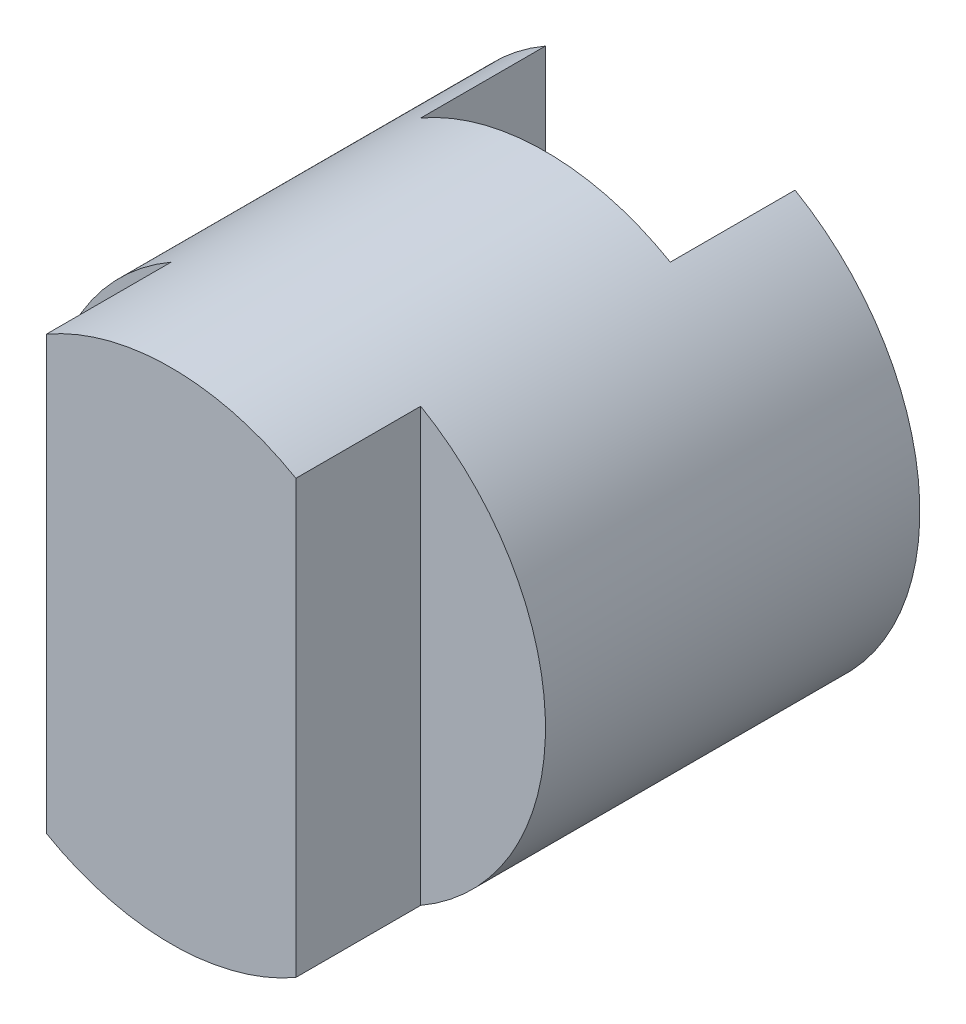
ISO-10303-21;
HEADER;
FILE_DESCRIPTION(('STEP AP214'),'2;1');
FILE_NAME('part.step','',(''),(''),'','','');
FILE_SCHEMA(('AUTOMOTIVE_DESIGN { 1 0 10303 214 1 1 1 1 }'));
ENDSEC;
DATA;
#1=APPLICATION_CONTEXT('core data for automotive mechanical design processes');
#2=APPLICATION_PROTOCOL_DEFINITION('international standard','automotive_design',2000,#1);
#3=PRODUCT_CONTEXT('',#1,'mechanical');
#4=PRODUCT('Part','Part','',(#3));
#5=PRODUCT_RELATED_PRODUCT_CATEGORY('part','',(#4));
#6=PRODUCT_DEFINITION_FORMATION('','',#4);
#7=PRODUCT_DEFINITION_CONTEXT('part definition',#1,'design');
#8=PRODUCT_DEFINITION('design','',#6,#7);
#9=PRODUCT_DEFINITION_SHAPE('','',#8);
#10=(LENGTH_UNIT() NAMED_UNIT(*) SI_UNIT(.MILLI.,.METRE.));
#11=(NAMED_UNIT(*) PLANE_ANGLE_UNIT() SI_UNIT($,.RADIAN.));
#12=(NAMED_UNIT(*) SI_UNIT($,.STERADIAN.) SOLID_ANGLE_UNIT());
#13=UNCERTAINTY_MEASURE_WITH_UNIT(LENGTH_MEASURE(1.E-05),#10,'distance_accuracy_value','');
#14=(GEOMETRIC_REPRESENTATION_CONTEXT(3) GLOBAL_UNCERTAINTY_ASSIGNED_CONTEXT((#13)) GLOBAL_UNIT_ASSIGNED_CONTEXT((#10,
#11,#12)) REPRESENTATION_CONTEXT('',''));
#15=CARTESIAN_POINT('',(0.,0.,0.));
#16=DIRECTION('',(0.,0.,1.));
#17=DIRECTION('',(1.,0.,0.));
#18=AXIS2_PLACEMENT_3D('',#15,#16,#17);
#19=CARTESIAN_POINT('',(0.,0.,0.));
#20=DIRECTION('',(0.,0.,1.));
#21=DIRECTION('',(1.,0.,0.));
#22=AXIS2_PLACEMENT_3D('',#19,#20,#21);
#23=PLANE('',#22);
#24=CARTESIAN_POINT('',(0.,0.,0.));
#25=DIRECTION('',(0.,0.,1.));
#26=DIRECTION('',(1.,0.,0.));
#27=AXIS2_PLACEMENT_3D('',#24,#25,#26);
#28=CIRCLE('',#27,2.);
#29=CARTESIAN_POINT('',(1.,-1.73205080756888,0.));
#30=VERTEX_POINT('',#29);
#31=CARTESIAN_POINT('',(1.,1.73205080756888,0.));
#32=VERTEX_POINT('',#31);
#33=EDGE_CURVE('E122',#30,#32,#28,.T.);
#34=ORIENTED_EDGE('',*,*,#33,.F.);
#35=DIRECTION('',(0.,1.,0.));
#36=VECTOR('',#35,1.);
#37=CARTESIAN_POINT('',(1.,0.,0.));
#38=LINE('',#37,#36);
#39=EDGE_CURVE('E109',#30,#32,#38,.T.);
#40=ORIENTED_EDGE('',*,*,#39,.T.);
#41=EDGE_LOOP('',(#34,#40));
#42=FACE_BOUND('',#41,.T.);
#43=ADVANCED_FACE('F32',(#42),#23,.F.);
#44=CARTESIAN_POINT('',(0.,0.,4.));
#45=DIRECTION('',(0.,0.,-1.));
#46=DIRECTION('',(-1.,0.,0.));
#47=AXIS2_PLACEMENT_3D('',#44,#45,#46);
#48=CYLINDRICAL_SURFACE('',#47,2.);
#49=CARTESIAN_POINT('',(0.,0.,4.));
#50=DIRECTION('',(0.,0.,1.));
#51=DIRECTION('',(1.,0.,0.));
#52=AXIS2_PLACEMENT_3D('',#49,#50,#51);
#53=CIRCLE('',#52,2.);
#54=CARTESIAN_POINT('',(-1.,-1.73205080756888,4.));
#55=VERTEX_POINT('',#54);
#56=CARTESIAN_POINT('',(1.,-1.73205080756888,4.));
#57=VERTEX_POINT('',#56);
#58=EDGE_CURVE('E121',#55,#57,#53,.T.);
#59=ORIENTED_EDGE('',*,*,#58,.F.);
#60=DIRECTION('',(0.,0.,-1.));
#61=VECTOR('',#60,1.);
#62=CARTESIAN_POINT('',(-1.,-1.73205080756888,4.));
#63=LINE('',#62,#61);
#64=CARTESIAN_POINT('',(-1.,-1.73205080756888,3.));
#65=VERTEX_POINT('',#64);
#66=EDGE_CURVE('E47',#55,#65,#63,.T.);
#67=ORIENTED_EDGE('',*,*,#66,.T.);
#68=CARTESIAN_POINT('',(0.,0.,3.));
#69=DIRECTION('',(0.,0.,-1.));
#70=DIRECTION('',(-1.,0.,0.));
#71=AXIS2_PLACEMENT_3D('',#68,#69,#70);
#72=CIRCLE('',#71,2.);
#73=CARTESIAN_POINT('',(-1.,1.73205080756888,3.));
#74=VERTEX_POINT('',#73);
#75=EDGE_CURVE('E11',#65,#74,#72,.T.);
#76=ORIENTED_EDGE('',*,*,#75,.T.);
#77=DIRECTION('',(0.,0.,-1.));
#78=VECTOR('',#77,1.);
#79=CARTESIAN_POINT('',(-1.,1.73205080756888,4.));
#80=LINE('',#79,#78);
#81=CARTESIAN_POINT('',(-1.,1.73205080756888,4.));
#82=VERTEX_POINT('',#81);
#83=EDGE_CURVE('E164',#74,#82,#80,.F.);
#84=ORIENTED_EDGE('',*,*,#83,.T.);
#85=CARTESIAN_POINT('',(1.,1.73205080756888,4.));
#86=VERTEX_POINT('',#85);
#87=EDGE_CURVE('E110',#86,#82,#53,.T.);
#88=ORIENTED_EDGE('',*,*,#87,.F.);
#89=DIRECTION('',(0.,0.,-1.));
#90=VECTOR('',#89,1.);
#91=CARTESIAN_POINT('',(1.,1.73205080756888,4.));
#92=LINE('',#91,#90);
#93=CARTESIAN_POINT('',(1.,1.73205080756888,3.));
#94=VERTEX_POINT('',#93);
#95=EDGE_CURVE('E55',#86,#94,#92,.T.);
#96=ORIENTED_EDGE('',*,*,#95,.T.);
#97=CARTESIAN_POINT('',(0.,0.,3.));
#98=DIRECTION('',(0.,0.,-1.));
#99=DIRECTION('',(-1.,0.,0.));
#100=AXIS2_PLACEMENT_3D('',#97,#98,#99);
#101=CIRCLE('',#100,2.);
#102=CARTESIAN_POINT('',(1.,-1.73205080756888,3.));
#103=VERTEX_POINT('',#102);
#104=EDGE_CURVE('E40',#94,#103,#101,.T.);
#105=ORIENTED_EDGE('',*,*,#104,.T.);
#106=DIRECTION('',(0.,0.,-1.));
#107=VECTOR('',#106,1.);
#108=CARTESIAN_POINT('',(1.,-1.73205080756888,4.));
#109=LINE('',#108,#107);
#110=EDGE_CURVE('E140',#103,#57,#109,.F.);
#111=ORIENTED_EDGE('',*,*,#110,.T.);
#112=EDGE_LOOP('',(#59,#67,#76,#84,#88,#96,#105,#111));
#113=FACE_BOUND('',#112,.T.);
#114=ORIENTED_EDGE('',*,*,#33,.T.);
#115=DIRECTION('',(0.,0.,-1.));
#116=VECTOR('',#115,1.);
#117=CARTESIAN_POINT('',(1.,1.73205080756888,4.));
#118=LINE('',#117,#116);
#119=CARTESIAN_POINT('',(1.,1.73205080756888,0.999683459501367));
#120=VERTEX_POINT('',#119);
#121=EDGE_CURVE('E118',#32,#120,#118,.F.);
#122=ORIENTED_EDGE('',*,*,#121,.T.);
#123=CARTESIAN_POINT('',(0.,0.,0.999683459501367));
#124=DIRECTION('',(0.,0.,1.));
#125=DIRECTION('',(1.,0.,0.));
#126=AXIS2_PLACEMENT_3D('',#123,#124,#125);
#127=CIRCLE('',#126,2.);
#128=CARTESIAN_POINT('',(-1.,1.73205080756888,0.999683459501367));
#129=VERTEX_POINT('',#128);
#130=EDGE_CURVE('E117',#120,#129,#127,.T.);
#131=ORIENTED_EDGE('',*,*,#130,.T.);
#132=DIRECTION('',(0.,0.,-1.));
#133=VECTOR('',#132,1.);
#134=CARTESIAN_POINT('',(-1.,1.73205080756888,4.));
#135=LINE('',#134,#133);
#136=CARTESIAN_POINT('',(-1.,1.73205080756888,0.));
#137=VERTEX_POINT('',#136);
#138=EDGE_CURVE('E102',#129,#137,#135,.T.);
#139=ORIENTED_EDGE('',*,*,#138,.T.);
#140=CARTESIAN_POINT('',(-1.,-1.73205080756888,0.));
#141=VERTEX_POINT('',#140);
#142=EDGE_CURVE('E115',#137,#141,#28,.T.);
#143=ORIENTED_EDGE('',*,*,#142,.T.);
#144=DIRECTION('',(0.,0.,-1.));
#145=VECTOR('',#144,1.);
#146=CARTESIAN_POINT('',(-1.,-1.73205080756888,4.));
#147=LINE('',#146,#145);
#148=CARTESIAN_POINT('',(-1.,-1.73205080756888,0.999683459501367));
#149=VERTEX_POINT('',#148);
#150=EDGE_CURVE('E105',#141,#149,#147,.F.);
#151=ORIENTED_EDGE('',*,*,#150,.T.);
#152=CARTESIAN_POINT('',(1.,-1.73205080756888,0.999683459501367));
#153=VERTEX_POINT('',#152);
#154=EDGE_CURVE('E134',#149,#153,#127,.T.);
#155=ORIENTED_EDGE('',*,*,#154,.T.);
#156=DIRECTION('',(0.,0.,-1.));
#157=VECTOR('',#156,1.);
#158=CARTESIAN_POINT('',(1.,-1.73205080756888,4.));
#159=LINE('',#158,#157);
#160=EDGE_CURVE('E159',#153,#30,#159,.T.);
#161=ORIENTED_EDGE('',*,*,#160,.T.);
#162=EDGE_LOOP('',(#114,#122,#131,#139,#143,#151,#155,#161));
#163=FACE_BOUND('',#162,.T.);
#164=ADVANCED_FACE('F34',(#113,#163),#48,.T.);
#165=CARTESIAN_POINT('',(0.,0.,4.));
#166=DIRECTION('',(0.,0.,1.));
#167=DIRECTION('',(1.,0.,0.));
#168=AXIS2_PLACEMENT_3D('',#165,#166,#167);
#169=PLANE('',#168);
#170=DIRECTION('',(0.,1.,0.));
#171=VECTOR('',#170,1.);
#172=CARTESIAN_POINT('',(-1.,0.,4.));
#173=LINE('',#172,#171);
#174=EDGE_CURVE('E132',#55,#82,#173,.T.);
#175=ORIENTED_EDGE('',*,*,#174,.F.);
#176=ORIENTED_EDGE('',*,*,#58,.T.);
#177=DIRECTION('',(0.,-1.,0.));
#178=VECTOR('',#177,1.);
#179=CARTESIAN_POINT('',(1.,0.,4.));
#180=LINE('',#179,#178);
#181=EDGE_CURVE('E130',#86,#57,#180,.T.);
#182=ORIENTED_EDGE('',*,*,#181,.F.);
#183=ORIENTED_EDGE('',*,*,#87,.T.);
#184=EDGE_LOOP('',(#175,#176,#182,#183));
#185=FACE_BOUND('',#184,.T.);
#186=ADVANCED_FACE('F167',(#185),#169,.T.);
#187=ORIENTED_EDGE('',*,*,#142,.F.);
#188=DIRECTION('',(0.,-1.,0.));
#189=VECTOR('',#188,1.);
#190=CARTESIAN_POINT('',(-1.,0.,0.));
#191=LINE('',#190,#189);
#192=EDGE_CURVE('E98',#137,#141,#191,.T.);
#193=ORIENTED_EDGE('',*,*,#192,.T.);
#194=EDGE_LOOP('',(#187,#193));
#195=FACE_BOUND('',#194,.T.);
#196=ADVANCED_FACE('F120',(#195),#23,.F.);
#197=CARTESIAN_POINT('',(-1.,-5.,0.999683459501367));
#198=DIRECTION('',(0.,0.,1.));
#199=DIRECTION('',(1.,0.,0.));
#200=AXIS2_PLACEMENT_3D('',#197,#198,#199);
#201=PLANE('',#200);
#202=DIRECTION('',(0.,1.,0.));
#203=VECTOR('',#202,1.);
#204=CARTESIAN_POINT('',(1.,-5.,0.999683459501367));
#205=LINE('',#204,#203);
#206=EDGE_CURVE('E148',#153,#120,#205,.T.);
#207=ORIENTED_EDGE('',*,*,#206,.F.);
#208=ORIENTED_EDGE('',*,*,#154,.F.);
#209=DIRECTION('',(0.,1.,0.));
#210=VECTOR('',#209,1.);
#211=CARTESIAN_POINT('',(-1.,-5.,0.999683459501367));
#212=LINE('',#211,#210);
#213=EDGE_CURVE('E153',#149,#129,#212,.T.);
#214=ORIENTED_EDGE('',*,*,#213,.T.);
#215=ORIENTED_EDGE('',*,*,#130,.F.);
#216=EDGE_LOOP('',(#207,#208,#214,#215));
#217=FACE_BOUND('',#216,.T.);
#218=ADVANCED_FACE('F188',(#217),#201,.F.);
#219=CARTESIAN_POINT('',(1.,-5.,0.999683459501367));
#220=DIRECTION('',(1.,0.,0.));
#221=DIRECTION('',(0.,0.,-1.));
#222=AXIS2_PLACEMENT_3D('',#219,#220,#221);
#223=PLANE('',#222);
#224=ORIENTED_EDGE('',*,*,#206,.T.);
#225=ORIENTED_EDGE('',*,*,#121,.F.);
#226=ORIENTED_EDGE('',*,*,#39,.F.);
#227=ORIENTED_EDGE('',*,*,#160,.F.);
#228=EDGE_LOOP('',(#224,#225,#226,#227));
#229=FACE_BOUND('',#228,.T.);
#230=ADVANCED_FACE('F194',(#229),#223,.F.);
#231=CARTESIAN_POINT('',(-1.,-5.,0.));
#232=DIRECTION('',(-1.,0.,0.));
#233=DIRECTION('',(0.,0.,1.));
#234=AXIS2_PLACEMENT_3D('',#231,#232,#233);
#235=PLANE('',#234);
#236=ORIENTED_EDGE('',*,*,#213,.F.);
#237=ORIENTED_EDGE('',*,*,#150,.F.);
#238=ORIENTED_EDGE('',*,*,#192,.F.);
#239=ORIENTED_EDGE('',*,*,#138,.F.);
#240=EDGE_LOOP('',(#236,#237,#238,#239));
#241=FACE_BOUND('',#240,.T.);
#242=ADVANCED_FACE('F101',(#241),#235,.F.);
#243=CARTESIAN_POINT('',(1.,-5.,3.));
#244=DIRECTION('',(-1.,0.,0.));
#245=DIRECTION('',(0.,0.,1.));
#246=AXIS2_PLACEMENT_3D('',#243,#244,#245);
#247=PLANE('',#246);
#248=ORIENTED_EDGE('',*,*,#181,.T.);
#249=ORIENTED_EDGE('',*,*,#110,.F.);
#250=DIRECTION('',(0.,1.,0.));
#251=VECTOR('',#250,1.);
#252=CARTESIAN_POINT('',(1.,-5.,3.));
#253=LINE('',#252,#251);
#254=EDGE_CURVE('E145',#103,#94,#253,.T.);
#255=ORIENTED_EDGE('',*,*,#254,.T.);
#256=ORIENTED_EDGE('',*,*,#95,.F.);
#257=EDGE_LOOP('',(#248,#249,#255,#256));
#258=FACE_BOUND('',#257,.T.);
#259=ADVANCED_FACE('F146',(#258),#247,.F.);
#260=CARTESIAN_POINT('',(2.,-5.,3.));
#261=DIRECTION('',(0.,0.,-1.));
#262=DIRECTION('',(-1.,0.,0.));
#263=AXIS2_PLACEMENT_3D('',#260,#261,#262);
#264=PLANE('',#263);
#265=ORIENTED_EDGE('',*,*,#254,.F.);
#266=ORIENTED_EDGE('',*,*,#104,.F.);
#267=EDGE_LOOP('',(#265,#266));
#268=FACE_BOUND('',#267,.T.);
#269=ADVANCED_FACE('F144',(#268),#264,.F.);
#270=CARTESIAN_POINT('',(-1.,-5.,3.));
#271=DIRECTION('',(0.,0.,-1.));
#272=DIRECTION('',(-1.,0.,0.));
#273=AXIS2_PLACEMENT_3D('',#270,#271,#272);
#274=PLANE('',#273);
#275=DIRECTION('',(0.,1.,0.));
#276=VECTOR('',#275,1.);
#277=CARTESIAN_POINT('',(-1.,-5.,3.));
#278=LINE('',#277,#276);
#279=EDGE_CURVE('E147',#65,#74,#278,.T.);
#280=ORIENTED_EDGE('',*,*,#279,.T.);
#281=ORIENTED_EDGE('',*,*,#75,.F.);
#282=EDGE_LOOP('',(#280,#281));
#283=FACE_BOUND('',#282,.T.);
#284=ADVANCED_FACE('F171',(#283),#274,.F.);
#285=CARTESIAN_POINT('',(-1.,-5.,4.26455627023164));
#286=DIRECTION('',(1.,0.,0.));
#287=DIRECTION('',(0.,0.,-1.));
#288=AXIS2_PLACEMENT_3D('',#285,#286,#287);
#289=PLANE('',#288);
#290=ORIENTED_EDGE('',*,*,#174,.T.);
#291=ORIENTED_EDGE('',*,*,#83,.F.);
#292=ORIENTED_EDGE('',*,*,#279,.F.);
#293=ORIENTED_EDGE('',*,*,#66,.F.);
#294=EDGE_LOOP('',(#290,#291,#292,#293));
#295=FACE_BOUND('',#294,.T.);
#296=ADVANCED_FACE('F169',(#295),#289,.F.);
#297=CLOSED_SHELL('',(#43,#164,#186,#196,#218,#230,#242,#259,#269,#284,#296));
#298=MANIFOLD_SOLID_BREP('B2',#297);
#299=ADVANCED_BREP_SHAPE_REPRESENTATION('',(#18,#298),#14);
#300=SHAPE_DEFINITION_REPRESENTATION(#9,#299);
ENDSEC;
END-ISO-10303-21;
